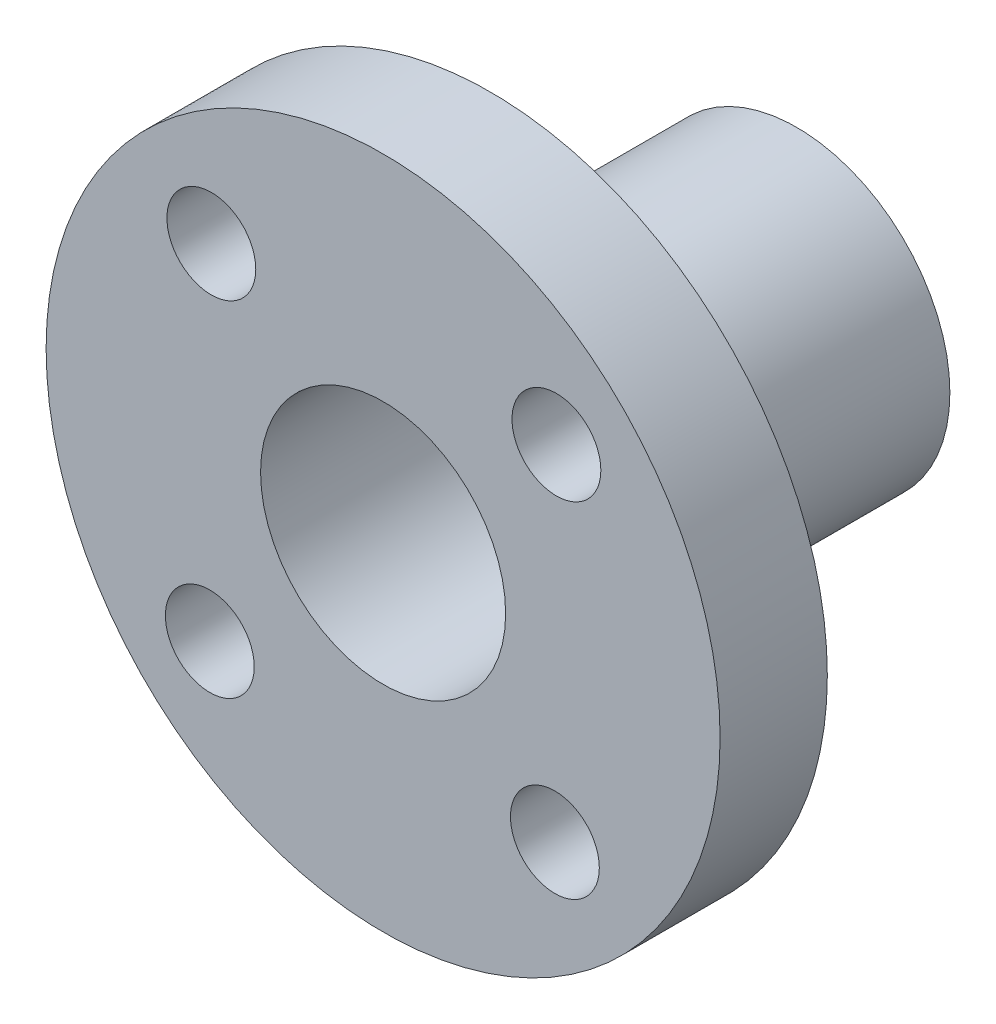
ISO-10303-21;
HEADER;
FILE_DESCRIPTION(('STEP AP214'),'2;1');
FILE_NAME('part.step','',(''),(''),'','','');
FILE_SCHEMA(('AUTOMOTIVE_DESIGN { 1 0 10303 214 1 1 1 1 }'));
ENDSEC;
DATA;
#1=APPLICATION_CONTEXT('core data for automotive mechanical design processes');
#2=APPLICATION_PROTOCOL_DEFINITION('international standard','automotive_design',2000,#1);
#3=PRODUCT_CONTEXT('',#1,'mechanical');
#4=PRODUCT('Part','Part','',(#3));
#5=PRODUCT_RELATED_PRODUCT_CATEGORY('part','',(#4));
#6=PRODUCT_DEFINITION_FORMATION('','',#4);
#7=PRODUCT_DEFINITION_CONTEXT('part definition',#1,'design');
#8=PRODUCT_DEFINITION('design','',#6,#7);
#9=PRODUCT_DEFINITION_SHAPE('','',#8);
#10=(LENGTH_UNIT() NAMED_UNIT(*) SI_UNIT(.MILLI.,.METRE.));
#11=(NAMED_UNIT(*) PLANE_ANGLE_UNIT() SI_UNIT($,.RADIAN.));
#12=(NAMED_UNIT(*) SI_UNIT($,.STERADIAN.) SOLID_ANGLE_UNIT());
#13=UNCERTAINTY_MEASURE_WITH_UNIT(LENGTH_MEASURE(1.E-05),#10,'distance_accuracy_value','');
#14=(GEOMETRIC_REPRESENTATION_CONTEXT(3) GLOBAL_UNCERTAINTY_ASSIGNED_CONTEXT((#13)) GLOBAL_UNIT_ASSIGNED_CONTEXT((#10,
#11,#12)) REPRESENTATION_CONTEXT('',''));
#15=CARTESIAN_POINT('',(0.,0.,0.));
#16=DIRECTION('',(0.,0.,1.));
#17=DIRECTION('',(1.,0.,0.));
#18=AXIS2_PLACEMENT_3D('',#15,#16,#17);
#19=CARTESIAN_POINT('',(0.,0.,0.));
#20=DIRECTION('',(0.,0.,1.));
#21=DIRECTION('',(1.,0.,0.));
#22=AXIS2_PLACEMENT_3D('',#19,#20,#21);
#23=PLANE('',#22);
#24=CARTESIAN_POINT('',(0.0499999620539732,219.949999999969,0.));
#25=DIRECTION('',(0.,0.,1.));
#26=DIRECTION('',(1.,0.,0.));
#27=AXIS2_PLACEMENT_3D('',#24,#25,#26);
#28=CIRCLE('',#27,11.);
#29=CARTESIAN_POINT('',(11.049999962054,219.949999999969,0.));
#30=VERTEX_POINT('',#29);
#31=EDGE_CURVE('E64',#30,#30,#28,.T.);
#32=ORIENTED_EDGE('',*,*,#31,.F.);
#33=EDGE_LOOP('',(#32));
#34=FACE_BOUND('',#33,.T.);
#35=CARTESIAN_POINT('',(5.65685422796516,214.293145824001,0.));
#36=DIRECTION('',(0.,0.,1.));
#37=DIRECTION('',(1.,0.,0.));
#38=AXIS2_PLACEMENT_3D('',#35,#36,#37);
#39=CIRCLE('',#38,1.45000000000023);
#40=CARTESIAN_POINT('',(7.10685422796539,214.293145824001,0.));
#41=VERTEX_POINT('',#40);
#42=EDGE_CURVE('E62',#41,#41,#39,.T.);
#43=ORIENTED_EDGE('',*,*,#42,.T.);
#44=EDGE_LOOP('',(#43));
#45=FACE_BOUND('',#44,.T.);
#46=CARTESIAN_POINT('',(-5.60685421391427,214.343145734058,0.));
#47=DIRECTION('',(0.,0.,1.));
#48=DIRECTION('',(1.,0.,0.));
#49=AXIS2_PLACEMENT_3D('',#46,#47,#48);
#50=CIRCLE('',#49,1.45000000000023);
#51=CARTESIAN_POINT('',(-4.15685421391404,214.343145734058,0.));
#52=VERTEX_POINT('',#51);
#53=EDGE_CURVE('E59',#52,#52,#50,.T.);
#54=ORIENTED_EDGE('',*,*,#53,.T.);
#55=EDGE_LOOP('',(#54));
#56=FACE_BOUND('',#55,.T.);
#57=CARTESIAN_POINT('',(-5.55685430385717,225.606854175937,0.));
#58=DIRECTION('',(0.,0.,1.));
#59=DIRECTION('',(1.,0.,0.));
#60=AXIS2_PLACEMENT_3D('',#57,#58,#59);
#61=CIRCLE('',#60,1.45000000000023);
#62=CARTESIAN_POINT('',(-4.10685430385695,225.606854175937,0.));
#63=VERTEX_POINT('',#62);
#64=EDGE_CURVE('E55',#63,#63,#61,.T.);
#65=ORIENTED_EDGE('',*,*,#64,.T.);
#66=EDGE_LOOP('',(#65));
#67=FACE_BOUND('',#66,.T.);
#68=CARTESIAN_POINT('',(5.70685413802219,225.55685426588,0.));
#69=DIRECTION('',(0.,0.,1.));
#70=DIRECTION('',(1.,0.,0.));
#71=AXIS2_PLACEMENT_3D('',#68,#69,#70);
#72=CIRCLE('',#71,1.45000000000022);
#73=CARTESIAN_POINT('',(7.15685413802241,225.55685426588,0.));
#74=VERTEX_POINT('',#73);
#75=EDGE_CURVE('E52',#74,#74,#72,.T.);
#76=ORIENTED_EDGE('',*,*,#75,.T.);
#77=EDGE_LOOP('',(#76));
#78=FACE_BOUND('',#77,.T.);
#79=CARTESIAN_POINT('',(0.0499999620539743,219.949999999969,0.));
#80=DIRECTION('',(0.,0.,1.));
#81=DIRECTION('',(1.,0.,0.));
#82=AXIS2_PLACEMENT_3D('',#79,#80,#81);
#83=CIRCLE('',#82,5.);
#84=CARTESIAN_POINT('',(5.04999996205398,219.949999999969,0.));
#85=VERTEX_POINT('',#84);
#86=EDGE_CURVE('E10',#85,#85,#83,.F.);
#87=ORIENTED_EDGE('',*,*,#86,.F.);
#88=EDGE_LOOP('',(#87));
#89=FACE_BOUND('',#88,.T.);
#90=ADVANCED_FACE('F32',(#34,#45,#56,#67,#78,#89),#23,.F.);
#91=CARTESIAN_POINT('',(0.0499999620539732,219.949999999969,3.5));
#92=DIRECTION('',(0.,0.,-1.));
#93=DIRECTION('',(-1.,0.,0.));
#94=AXIS2_PLACEMENT_3D('',#91,#92,#93);
#95=CYLINDRICAL_SURFACE('',#94,4.);
#96=CARTESIAN_POINT('',(0.0499999620539732,219.949999999969,3.5));
#97=DIRECTION('',(0.,0.,1.));
#98=DIRECTION('',(1.,0.,0.));
#99=AXIS2_PLACEMENT_3D('',#96,#97,#98);
#100=CIRCLE('',#99,4.);
#101=CARTESIAN_POINT('',(4.04999996205397,219.949999999969,3.5));
#102=VERTEX_POINT('',#101);
#103=EDGE_CURVE('E43',#102,#102,#100,.T.);
#104=ORIENTED_EDGE('',*,*,#103,.T.);
#105=EDGE_LOOP('',(#104));
#106=FACE_BOUND('',#105,.T.);
#107=CARTESIAN_POINT('',(0.0499999620539743,219.949999999969,-10.));
#108=DIRECTION('',(0.,0.,-1.));
#109=DIRECTION('',(-1.,0.,0.));
#110=AXIS2_PLACEMENT_3D('',#107,#108,#109);
#111=CIRCLE('',#110,4.);
#112=CARTESIAN_POINT('',(-3.95000003794603,219.949999999969,-10.));
#113=VERTEX_POINT('',#112);
#114=EDGE_CURVE('E102',#113,#113,#111,.T.);
#115=ORIENTED_EDGE('',*,*,#114,.T.);
#116=EDGE_LOOP('',(#115));
#117=FACE_BOUND('',#116,.T.);
#118=ADVANCED_FACE('F96',(#106,#117),#95,.F.);
#119=CARTESIAN_POINT('',(5.65685422796516,214.293145824001,3.5));
#120=DIRECTION('',(0.,0.,-1.));
#121=DIRECTION('',(-1.,0.,0.));
#122=AXIS2_PLACEMENT_3D('',#119,#120,#121);
#123=CYLINDRICAL_SURFACE('',#122,1.45000000000023);
#124=CARTESIAN_POINT('',(5.65685422796516,214.293145824001,3.5));
#125=DIRECTION('',(0.,0.,1.));
#126=DIRECTION('',(1.,0.,0.));
#127=AXIS2_PLACEMENT_3D('',#124,#125,#126);
#128=CIRCLE('',#127,1.45000000000023);
#129=CARTESIAN_POINT('',(7.10685422796539,214.293145824001,3.5));
#130=VERTEX_POINT('',#129);
#131=EDGE_CURVE('E48',#130,#130,#128,.T.);
#132=ORIENTED_EDGE('',*,*,#131,.T.);
#133=EDGE_LOOP('',(#132));
#134=FACE_BOUND('',#133,.T.);
#135=ORIENTED_EDGE('',*,*,#42,.F.);
#136=EDGE_LOOP('',(#135));
#137=FACE_BOUND('',#136,.T.);
#138=ADVANCED_FACE('F84',(#134,#137),#123,.F.);
#139=CARTESIAN_POINT('',(-5.60685421391427,214.343145734058,3.5));
#140=DIRECTION('',(0.,0.,-1.));
#141=DIRECTION('',(-1.,0.,0.));
#142=AXIS2_PLACEMENT_3D('',#139,#140,#141);
#143=CYLINDRICAL_SURFACE('',#142,1.45000000000023);
#144=CARTESIAN_POINT('',(-5.60685421391427,214.343145734058,3.5));
#145=DIRECTION('',(0.,0.,1.));
#146=DIRECTION('',(1.,0.,0.));
#147=AXIS2_PLACEMENT_3D('',#144,#145,#146);
#148=CIRCLE('',#147,1.45000000000023);
#149=CARTESIAN_POINT('',(-4.15685421391404,214.343145734058,3.5));
#150=VERTEX_POINT('',#149);
#151=EDGE_CURVE('E75',#150,#150,#148,.T.);
#152=ORIENTED_EDGE('',*,*,#151,.T.);
#153=EDGE_LOOP('',(#152));
#154=FACE_BOUND('',#153,.T.);
#155=ORIENTED_EDGE('',*,*,#53,.F.);
#156=EDGE_LOOP('',(#155));
#157=FACE_BOUND('',#156,.T.);
#158=ADVANCED_FACE('F127',(#154,#157),#143,.F.);
#159=CARTESIAN_POINT('',(-5.55685430385717,225.606854175937,3.5));
#160=DIRECTION('',(0.,0.,-1.));
#161=DIRECTION('',(-1.,0.,0.));
#162=AXIS2_PLACEMENT_3D('',#159,#160,#161);
#163=CYLINDRICAL_SURFACE('',#162,1.45000000000023);
#164=CARTESIAN_POINT('',(-5.55685430385717,225.606854175937,3.5));
#165=DIRECTION('',(0.,0.,1.));
#166=DIRECTION('',(1.,0.,0.));
#167=AXIS2_PLACEMENT_3D('',#164,#165,#166);
#168=CIRCLE('',#167,1.45000000000023);
#169=CARTESIAN_POINT('',(-4.10685430385695,225.606854175937,3.5));
#170=VERTEX_POINT('',#169);
#171=EDGE_CURVE('E70',#170,#170,#168,.T.);
#172=ORIENTED_EDGE('',*,*,#171,.T.);
#173=EDGE_LOOP('',(#172));
#174=FACE_BOUND('',#173,.T.);
#175=ORIENTED_EDGE('',*,*,#64,.F.);
#176=EDGE_LOOP('',(#175));
#177=FACE_BOUND('',#176,.T.);
#178=ADVANCED_FACE('F129',(#174,#177),#163,.F.);
#179=CARTESIAN_POINT('',(5.70685413802219,225.55685426588,3.5));
#180=DIRECTION('',(0.,0.,-1.));
#181=DIRECTION('',(-1.,0.,0.));
#182=AXIS2_PLACEMENT_3D('',#179,#180,#181);
#183=CYLINDRICAL_SURFACE('',#182,1.45000000000022);
#184=CARTESIAN_POINT('',(5.70685413802219,225.55685426588,3.5));
#185=DIRECTION('',(0.,0.,1.));
#186=DIRECTION('',(1.,0.,0.));
#187=AXIS2_PLACEMENT_3D('',#184,#185,#186);
#188=CIRCLE('',#187,1.45000000000022);
#189=CARTESIAN_POINT('',(7.15685413802241,225.55685426588,3.5));
#190=VERTEX_POINT('',#189);
#191=EDGE_CURVE('E66',#190,#190,#188,.T.);
#192=ORIENTED_EDGE('',*,*,#191,.T.);
#193=EDGE_LOOP('',(#192));
#194=FACE_BOUND('',#193,.T.);
#195=ORIENTED_EDGE('',*,*,#75,.F.);
#196=EDGE_LOOP('',(#195));
#197=FACE_BOUND('',#196,.T.);
#198=ADVANCED_FACE('F34',(#194,#197),#183,.F.);
#199=CARTESIAN_POINT('',(0.0499999620539732,219.949999999969,3.5));
#200=DIRECTION('',(0.,0.,-1.));
#201=DIRECTION('',(-1.,0.,0.));
#202=AXIS2_PLACEMENT_3D('',#199,#200,#201);
#203=CYLINDRICAL_SURFACE('',#202,11.);
#204=CARTESIAN_POINT('',(0.0499999620539732,219.949999999969,3.5));
#205=DIRECTION('',(0.,0.,1.));
#206=DIRECTION('',(1.,0.,0.));
#207=AXIS2_PLACEMENT_3D('',#204,#205,#206);
#208=CIRCLE('',#207,11.);
#209=CARTESIAN_POINT('',(11.049999962054,219.949999999969,3.5));
#210=VERTEX_POINT('',#209);
#211=EDGE_CURVE('E39',#210,#210,#208,.T.);
#212=ORIENTED_EDGE('',*,*,#211,.F.);
#213=EDGE_LOOP('',(#212));
#214=FACE_BOUND('',#213,.T.);
#215=ORIENTED_EDGE('',*,*,#31,.T.);
#216=EDGE_LOOP('',(#215));
#217=FACE_BOUND('',#216,.T.);
#218=ADVANCED_FACE('F91',(#214,#217),#203,.T.);
#219=CARTESIAN_POINT('',(0.,0.,3.5));
#220=DIRECTION('',(0.,0.,1.));
#221=DIRECTION('',(1.,0.,0.));
#222=AXIS2_PLACEMENT_3D('',#219,#220,#221);
#223=PLANE('',#222);
#224=ORIENTED_EDGE('',*,*,#191,.F.);
#225=EDGE_LOOP('',(#224));
#226=FACE_BOUND('',#225,.T.);
#227=ORIENTED_EDGE('',*,*,#171,.F.);
#228=EDGE_LOOP('',(#227));
#229=FACE_BOUND('',#228,.T.);
#230=ORIENTED_EDGE('',*,*,#151,.F.);
#231=EDGE_LOOP('',(#230));
#232=FACE_BOUND('',#231,.T.);
#233=ORIENTED_EDGE('',*,*,#131,.F.);
#234=EDGE_LOOP('',(#233));
#235=FACE_BOUND('',#234,.T.);
#236=ORIENTED_EDGE('',*,*,#103,.F.);
#237=EDGE_LOOP('',(#236));
#238=FACE_BOUND('',#237,.T.);
#239=ORIENTED_EDGE('',*,*,#211,.T.);
#240=EDGE_LOOP('',(#239));
#241=FACE_BOUND('',#240,.T.);
#242=ADVANCED_FACE('F87',(#226,#229,#232,#235,#238,#241),#223,.T.);
#243=CARTESIAN_POINT('',(0.0499999620539743,219.949999999969,-10.));
#244=DIRECTION('',(0.,0.,-1.));
#245=DIRECTION('',(-1.,0.,0.));
#246=AXIS2_PLACEMENT_3D('',#243,#244,#245);
#247=PLANE('',#246);
#248=CARTESIAN_POINT('',(0.0499999620539743,219.949999999969,-10.));
#249=DIRECTION('',(0.,0.,-1.));
#250=DIRECTION('',(-1.,0.,0.));
#251=AXIS2_PLACEMENT_3D('',#248,#249,#250);
#252=CIRCLE('',#251,5.);
#253=CARTESIAN_POINT('',(-4.95000003794603,219.949999999969,-10.));
#254=VERTEX_POINT('',#253);
#255=EDGE_CURVE('E56',#254,#254,#252,.T.);
#256=ORIENTED_EDGE('',*,*,#255,.T.);
#257=EDGE_LOOP('',(#256));
#258=FACE_BOUND('',#257,.T.);
#259=ORIENTED_EDGE('',*,*,#114,.F.);
#260=EDGE_LOOP('',(#259));
#261=FACE_BOUND('',#260,.T.);
#262=ADVANCED_FACE('F90',(#258,#261),#247,.T.);
#263=CARTESIAN_POINT('',(0.0499999620539743,219.949999999969,-10.));
#264=DIRECTION('',(0.,0.,1.));
#265=DIRECTION('',(1.,0.,0.));
#266=AXIS2_PLACEMENT_3D('',#263,#264,#265);
#267=CYLINDRICAL_SURFACE('',#266,5.);
#268=ORIENTED_EDGE('',*,*,#255,.F.);
#269=EDGE_LOOP('',(#268));
#270=FACE_BOUND('',#269,.T.);
#271=ORIENTED_EDGE('',*,*,#86,.T.);
#272=EDGE_LOOP('',(#271));
#273=FACE_BOUND('',#272,.T.);
#274=ADVANCED_FACE('F108',(#270,#273),#267,.T.);
#275=CLOSED_SHELL('',(#90,#118,#138,#158,#178,#198,#218,#242,#262,#274));
#276=MANIFOLD_SOLID_BREP('B2',#275);
#277=ADVANCED_BREP_SHAPE_REPRESENTATION('',(#18,#276),#14);
#278=SHAPE_DEFINITION_REPRESENTATION(#9,#277);
ENDSEC;
END-ISO-10303-21;
